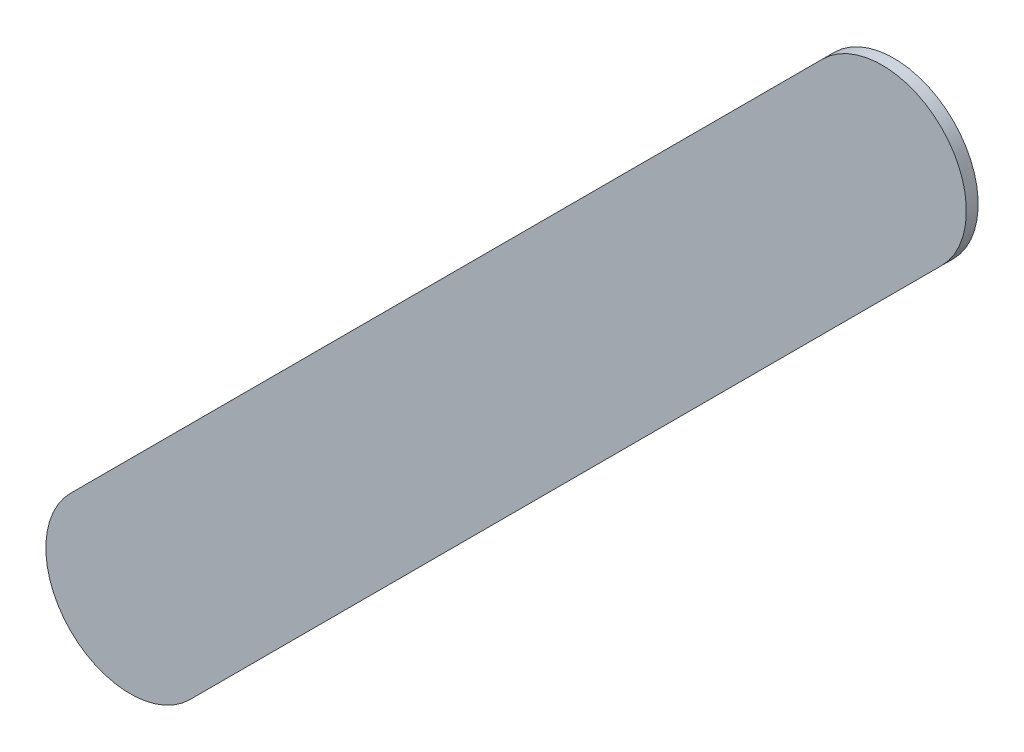
ISO-10303-21;
HEADER;
FILE_DESCRIPTION(('STEP AP214'),'2;1');
FILE_NAME('part.step','',(''),(''),'','','');
FILE_SCHEMA(('AUTOMOTIVE_DESIGN { 1 0 10303 214 1 1 1 1 }'));
ENDSEC;
DATA;
#1=APPLICATION_CONTEXT('core data for automotive mechanical design processes');
#2=APPLICATION_PROTOCOL_DEFINITION('international standard','automotive_design',2000,#1);
#3=PRODUCT_CONTEXT('',#1,'mechanical');
#4=PRODUCT('Part','Part','',(#3));
#5=PRODUCT_RELATED_PRODUCT_CATEGORY('part','',(#4));
#6=PRODUCT_DEFINITION_FORMATION('','',#4);
#7=PRODUCT_DEFINITION_CONTEXT('part definition',#1,'design');
#8=PRODUCT_DEFINITION('design','',#6,#7);
#9=PRODUCT_DEFINITION_SHAPE('','',#8);
#10=(LENGTH_UNIT() NAMED_UNIT(*) SI_UNIT(.MILLI.,.METRE.));
#11=(NAMED_UNIT(*) PLANE_ANGLE_UNIT() SI_UNIT($,.RADIAN.));
#12=(NAMED_UNIT(*) SI_UNIT($,.STERADIAN.) SOLID_ANGLE_UNIT());
#13=UNCERTAINTY_MEASURE_WITH_UNIT(LENGTH_MEASURE(1.E-05),#10,'distance_accuracy_value','');
#14=(GEOMETRIC_REPRESENTATION_CONTEXT(3) GLOBAL_UNCERTAINTY_ASSIGNED_CONTEXT((#13)) GLOBAL_UNIT_ASSIGNED_CONTEXT((#10,
#11,#12)) REPRESENTATION_CONTEXT('',''));
#15=CARTESIAN_POINT('',(0.,0.,0.));
#16=DIRECTION('',(0.,0.,1.));
#17=DIRECTION('',(1.,0.,0.));
#18=AXIS2_PLACEMENT_3D('',#15,#16,#17);
#19=CARTESIAN_POINT('',(126.978776,-108.578776,0.));
#20=DIRECTION('',(0.,0.,1.));
#21=DIRECTION('',(1.,0.,0.));
#22=AXIS2_PLACEMENT_3D('',#19,#20,#21);
#23=PLANE('',#22);
#24=DIRECTION('',(0.707106781186548,0.707106781186548,0.));
#25=VECTOR('',#24,1.);
#26=CARTESIAN_POINT('',(126.978776,-108.578776,0.));
#27=LINE('',#26,#25);
#28=CARTESIAN_POINT('',(126.978776,-108.578776,0.));
#29=VERTEX_POINT('',#28);
#30=CARTESIAN_POINT('',(129.208776,-106.348776,0.));
#31=VERTEX_POINT('',#30);
#32=EDGE_CURVE('E94',#29,#31,#27,.T.);
#33=ORIENTED_EDGE('',*,*,#32,.T.);
#34=CARTESIAN_POINT('',(129.0319995,-106.1719995,0.));
#35=DIRECTION('',(0.,0.,1.));
#36=DIRECTION('',(0.707106781186548,-0.707106781186548,0.));
#37=AXIS2_PLACEMENT_3D('',#34,#35,#36);
#38=CIRCLE('',#37,0.249999723809);
#39=CARTESIAN_POINT('',(128.855223,-105.995223,0.));
#40=VERTEX_POINT('',#39);
#41=EDGE_CURVE('E72',#31,#40,#38,.T.);
#42=ORIENTED_EDGE('',*,*,#41,.T.);
#43=DIRECTION('',(-0.707106781186548,-0.707106781186548,0.));
#44=VECTOR('',#43,1.);
#45=CARTESIAN_POINT('',(128.855223,-105.995223,0.));
#46=LINE('',#45,#44);
#47=CARTESIAN_POINT('',(126.625223,-108.225223,0.));
#48=VERTEX_POINT('',#47);
#49=EDGE_CURVE('E77',#40,#48,#46,.T.);
#50=ORIENTED_EDGE('',*,*,#49,.T.);
#51=CARTESIAN_POINT('',(126.8019995,-108.4019995,0.));
#52=DIRECTION('',(0.,0.,1.));
#53=DIRECTION('',(-0.707106781186548,0.707106781186548,0.));
#54=AXIS2_PLACEMENT_3D('',#51,#52,#53);
#55=CIRCLE('',#54,0.249999723809);
#56=EDGE_CURVE('E11',#48,#29,#55,.T.);
#57=ORIENTED_EDGE('',*,*,#56,.T.);
#58=EDGE_LOOP('',(#33,#42,#50,#57));
#59=FACE_BOUND('',#58,.T.);
#60=ADVANCED_FACE('F17',(#59),#23,.T.);
#61=CARTESIAN_POINT('',(126.978776,-108.578776,-0.035));
#62=DIRECTION('',(0.,0.,1.));
#63=DIRECTION('',(1.,0.,0.));
#64=AXIS2_PLACEMENT_3D('',#61,#62,#63);
#65=PLANE('',#64);
#66=CARTESIAN_POINT('',(126.8019995,-108.4019995,-0.035));
#67=DIRECTION('',(0.,0.,1.));
#68=DIRECTION('',(-0.707106781186548,0.707106781186548,0.));
#69=AXIS2_PLACEMENT_3D('',#66,#67,#68);
#70=CIRCLE('',#69,0.249999723809);
#71=CARTESIAN_POINT('',(126.625223,-108.225223,-0.035));
#72=VERTEX_POINT('',#71);
#73=CARTESIAN_POINT('',(126.978776,-108.578776,-0.035));
#74=VERTEX_POINT('',#73);
#75=EDGE_CURVE('E20',#72,#74,#70,.T.);
#76=ORIENTED_EDGE('',*,*,#75,.F.);
#77=DIRECTION('',(-0.707106781186548,-0.707106781186548,0.));
#78=VECTOR('',#77,1.);
#79=CARTESIAN_POINT('',(128.855223,-105.995223,-0.035));
#80=LINE('',#79,#78);
#81=CARTESIAN_POINT('',(128.855223,-105.995223,-0.035));
#82=VERTEX_POINT('',#81);
#83=EDGE_CURVE('E61',#82,#72,#80,.T.);
#84=ORIENTED_EDGE('',*,*,#83,.F.);
#85=CARTESIAN_POINT('',(129.0319995,-106.1719995,-0.035));
#86=DIRECTION('',(0.,0.,1.));
#87=DIRECTION('',(0.707106781186548,-0.707106781186548,0.));
#88=AXIS2_PLACEMENT_3D('',#85,#86,#87);
#89=CIRCLE('',#88,0.249999723809);
#90=CARTESIAN_POINT('',(129.208776,-106.348776,-0.035));
#91=VERTEX_POINT('',#90);
#92=EDGE_CURVE('E66',#91,#82,#89,.T.);
#93=ORIENTED_EDGE('',*,*,#92,.F.);
#94=DIRECTION('',(0.707106781186548,0.707106781186548,0.));
#95=VECTOR('',#94,1.);
#96=CARTESIAN_POINT('',(126.978776,-108.578776,-0.035));
#97=LINE('',#96,#95);
#98=EDGE_CURVE('E114',#74,#91,#97,.T.);
#99=ORIENTED_EDGE('',*,*,#98,.F.);
#100=EDGE_LOOP('',(#76,#84,#93,#99));
#101=FACE_BOUND('',#100,.T.);
#102=ADVANCED_FACE('F63',(#101),#65,.F.);
#103=CARTESIAN_POINT('',(126.8019995,-108.4019995,-0.035));
#104=DIRECTION('',(0.,0.,-1.));
#105=DIRECTION('',(-0.707106781186548,0.707106781186548,0.));
#106=AXIS2_PLACEMENT_3D('',#103,#104,#105);
#107=CYLINDRICAL_SURFACE('',#106,0.249999723809);
#108=ORIENTED_EDGE('',*,*,#75,.T.);
#109=DIRECTION('',(0.,0.,1.));
#110=VECTOR('',#109,1.);
#111=CARTESIAN_POINT('',(126.978776,-108.578776,-0.035));
#112=LINE('',#111,#110);
#113=EDGE_CURVE('E88',#74,#29,#112,.T.);
#114=ORIENTED_EDGE('',*,*,#113,.T.);
#115=ORIENTED_EDGE('',*,*,#56,.F.);
#116=DIRECTION('',(0.,0.,1.));
#117=VECTOR('',#116,1.);
#118=CARTESIAN_POINT('',(126.625223,-108.225223,-0.035));
#119=LINE('',#118,#117);
#120=EDGE_CURVE('E71',#72,#48,#119,.T.);
#121=ORIENTED_EDGE('',*,*,#120,.F.);
#122=EDGE_LOOP('',(#108,#114,#115,#121));
#123=FACE_BOUND('',#122,.T.);
#124=ADVANCED_FACE('F108',(#123),#107,.T.);
#125=CARTESIAN_POINT('',(128.855223,-105.995223,-0.035));
#126=DIRECTION('',(0.707106781186548,-0.707106781186548,0.));
#127=DIRECTION('',(0.,0.,-1.));
#128=AXIS2_PLACEMENT_3D('',#125,#126,#127);
#129=PLANE('',#128);
#130=ORIENTED_EDGE('',*,*,#83,.T.);
#131=ORIENTED_EDGE('',*,*,#120,.T.);
#132=ORIENTED_EDGE('',*,*,#49,.F.);
#133=DIRECTION('',(0.,0.,1.));
#134=VECTOR('',#133,1.);
#135=CARTESIAN_POINT('',(128.855223,-105.995223,-0.035));
#136=LINE('',#135,#134);
#137=EDGE_CURVE('E75',#82,#40,#136,.T.);
#138=ORIENTED_EDGE('',*,*,#137,.F.);
#139=EDGE_LOOP('',(#130,#131,#132,#138));
#140=FACE_BOUND('',#139,.T.);
#141=ADVANCED_FACE('F76',(#140),#129,.F.);
#142=CARTESIAN_POINT('',(129.0319995,-106.1719995,-0.035));
#143=DIRECTION('',(0.,0.,-1.));
#144=DIRECTION('',(0.707106781186548,-0.707106781186548,0.));
#145=AXIS2_PLACEMENT_3D('',#142,#143,#144);
#146=CYLINDRICAL_SURFACE('',#145,0.249999723809);
#147=ORIENTED_EDGE('',*,*,#92,.T.);
#148=ORIENTED_EDGE('',*,*,#137,.T.);
#149=ORIENTED_EDGE('',*,*,#41,.F.);
#150=DIRECTION('',(0.,0.,1.));
#151=VECTOR('',#150,1.);
#152=CARTESIAN_POINT('',(129.208776,-106.348776,-0.035));
#153=LINE('',#152,#151);
#154=EDGE_CURVE('E85',#91,#31,#153,.T.);
#155=ORIENTED_EDGE('',*,*,#154,.F.);
#156=EDGE_LOOP('',(#147,#148,#149,#155));
#157=FACE_BOUND('',#156,.T.);
#158=ADVANCED_FACE('F83',(#157),#146,.T.);
#159=CARTESIAN_POINT('',(126.978776,-108.578776,-0.035));
#160=DIRECTION('',(-0.707106781186548,0.707106781186548,0.));
#161=DIRECTION('',(0.,0.,1.));
#162=AXIS2_PLACEMENT_3D('',#159,#160,#161);
#163=PLANE('',#162);
#164=ORIENTED_EDGE('',*,*,#98,.T.);
#165=ORIENTED_EDGE('',*,*,#154,.T.);
#166=ORIENTED_EDGE('',*,*,#32,.F.);
#167=ORIENTED_EDGE('',*,*,#113,.F.);
#168=EDGE_LOOP('',(#164,#165,#166,#167));
#169=FACE_BOUND('',#168,.T.);
#170=ADVANCED_FACE('F113',(#169),#163,.F.);
#171=CLOSED_SHELL('',(#60,#102,#124,#141,#158,#170));
#172=MANIFOLD_SOLID_BREP('B1',#171);
#173=ADVANCED_BREP_SHAPE_REPRESENTATION('',(#18,#172),#14);
#174=SHAPE_DEFINITION_REPRESENTATION(#9,#173);
ENDSEC;
END-ISO-10303-21;
